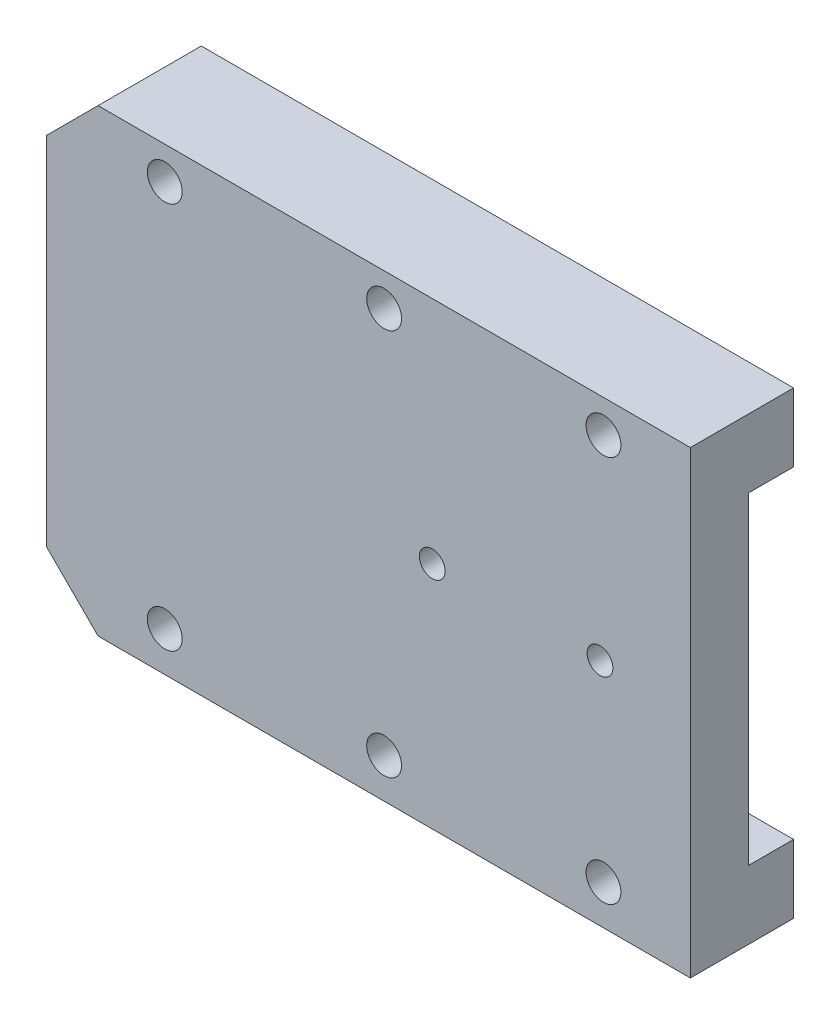
ISO-10303-21;
HEADER;
FILE_DESCRIPTION(('STEP AP214'),'2;1');
FILE_NAME('part.step','',(''),(''),'','','');
FILE_SCHEMA(('AUTOMOTIVE_DESIGN { 1 0 10303 214 1 1 1 1 }'));
ENDSEC;
DATA;
#1=APPLICATION_CONTEXT('core data for automotive mechanical design processes');
#2=APPLICATION_PROTOCOL_DEFINITION('international standard','automotive_design',2000,#1);
#3=PRODUCT_CONTEXT('',#1,'mechanical');
#4=PRODUCT('Part','Part','',(#3));
#5=PRODUCT_RELATED_PRODUCT_CATEGORY('part','',(#4));
#6=PRODUCT_DEFINITION_FORMATION('','',#4);
#7=PRODUCT_DEFINITION_CONTEXT('part definition',#1,'design');
#8=PRODUCT_DEFINITION('design','',#6,#7);
#9=PRODUCT_DEFINITION_SHAPE('','',#8);
#10=(LENGTH_UNIT() NAMED_UNIT(*) SI_UNIT(.MILLI.,.METRE.));
#11=(NAMED_UNIT(*) PLANE_ANGLE_UNIT() SI_UNIT($,.RADIAN.));
#12=(NAMED_UNIT(*) SI_UNIT($,.STERADIAN.) SOLID_ANGLE_UNIT());
#13=UNCERTAINTY_MEASURE_WITH_UNIT(LENGTH_MEASURE(1.E-05),#10,'distance_accuracy_value','');
#14=(GEOMETRIC_REPRESENTATION_CONTEXT(3) GLOBAL_UNCERTAINTY_ASSIGNED_CONTEXT((#13)) GLOBAL_UNIT_ASSIGNED_CONTEXT((#10,
#11,#12)) REPRESENTATION_CONTEXT('',''));
#15=CARTESIAN_POINT('',(0.,0.,0.));
#16=DIRECTION('',(0.,0.,1.));
#17=DIRECTION('',(1.,0.,0.));
#18=AXIS2_PLACEMENT_3D('',#15,#16,#17);
#19=CARTESIAN_POINT('',(0.,0.,-4.));
#20=DIRECTION('',(0.,0.,-1.));
#21=DIRECTION('',(-1.,0.,0.));
#22=AXIS2_PLACEMENT_3D('',#19,#20,#21);
#23=PLANE('',#22);
#24=DIRECTION('',(-1.,0.,0.));
#25=VECTOR('',#24,1.);
#26=CARTESIAN_POINT('',(22.5,12.5,-4.));
#27=LINE('',#26,#25);
#28=CARTESIAN_POINT('',(22.5,12.5,-4.));
#29=VERTEX_POINT('',#28);
#30=CARTESIAN_POINT('',(-27.4,12.5,-4.));
#31=VERTEX_POINT('',#30);
#32=EDGE_CURVE('E171',#29,#31,#27,.T.);
#33=ORIENTED_EDGE('',*,*,#32,.T.);
#34=DIRECTION('',(0.,1.,0.));
#35=VECTOR('',#34,1.);
#36=CARTESIAN_POINT('',(-27.4,17.8,-4.));
#37=LINE('',#36,#35);
#38=CARTESIAN_POINT('',(-27.4,13.8,-4.));
#39=VERTEX_POINT('',#38);
#40=EDGE_CURVE('E174',#31,#39,#37,.T.);
#41=ORIENTED_EDGE('',*,*,#40,.T.);
#42=DIRECTION('',(0.707106781186549,0.707106781186546,0.));
#43=VECTOR('',#42,1.);
#44=CARTESIAN_POINT('',(-20.6,20.6,-4.));
#45=LINE('',#44,#43);
#46=CARTESIAN_POINT('',(-23.4,17.8,-4.));
#47=VERTEX_POINT('',#46);
#48=EDGE_CURVE('E144',#39,#47,#45,.T.);
#49=ORIENTED_EDGE('',*,*,#48,.T.);
#50=DIRECTION('',(-1.,0.,0.));
#51=VECTOR('',#50,1.);
#52=CARTESIAN_POINT('',(22.5,17.8,-4.));
#53=LINE('',#52,#51);
#54=CARTESIAN_POINT('',(22.5,17.8,-4.));
#55=VERTEX_POINT('',#54);
#56=EDGE_CURVE('E122',#55,#47,#53,.T.);
#57=ORIENTED_EDGE('',*,*,#56,.F.);
#58=DIRECTION('',(0.,1.,0.));
#59=VECTOR('',#58,1.);
#60=CARTESIAN_POINT('',(22.5,17.8,-4.));
#61=LINE('',#60,#59);
#62=EDGE_CURVE('E123',#29,#55,#61,.T.);
#63=ORIENTED_EDGE('',*,*,#62,.F.);
#64=EDGE_LOOP('',(#33,#41,#49,#57,#63));
#65=FACE_BOUND('',#64,.T.);
#66=CARTESIAN_POINT('',(-18.2306151546301,15.26709885284,-4.));
#67=DIRECTION('',(0.,0.,-1.));
#68=DIRECTION('',(-1.,0.,0.));
#69=AXIS2_PLACEMENT_3D('',#66,#67,#68);
#70=CIRCLE('',#69,1.35);
#71=CARTESIAN_POINT('',(-19.5806151546301,15.26709885284,-4.));
#72=VERTEX_POINT('',#71);
#73=EDGE_CURVE('E191',#72,#72,#70,.T.);
#74=ORIENTED_EDGE('',*,*,#73,.F.);
#75=EDGE_LOOP('',(#74));
#76=FACE_BOUND('',#75,.T.);
#77=CARTESIAN_POINT('',(-1.23061515463011,15.2670988528399,-4.));
#78=DIRECTION('',(0.,0.,-1.));
#79=DIRECTION('',(-1.,0.,0.));
#80=AXIS2_PLACEMENT_3D('',#77,#78,#79);
#81=CIRCLE('',#80,1.35);
#82=CARTESIAN_POINT('',(-2.58061515463011,15.2670988528399,-4.));
#83=VERTEX_POINT('',#82);
#84=EDGE_CURVE('E185',#83,#83,#81,.T.);
#85=ORIENTED_EDGE('',*,*,#84,.F.);
#86=EDGE_LOOP('',(#85));
#87=FACE_BOUND('',#86,.T.);
#88=CARTESIAN_POINT('',(15.7693848453699,15.2670988528398,-4.));
#89=DIRECTION('',(0.,0.,-1.));
#90=DIRECTION('',(-1.,0.,0.));
#91=AXIS2_PLACEMENT_3D('',#88,#89,#90);
#92=CIRCLE('',#91,1.35);
#93=CARTESIAN_POINT('',(14.4193848453699,15.2670988528398,-4.));
#94=VERTEX_POINT('',#93);
#95=EDGE_CURVE('E180',#94,#94,#92,.T.);
#96=ORIENTED_EDGE('',*,*,#95,.F.);
#97=EDGE_LOOP('',(#96));
#98=FACE_BOUND('',#97,.T.);
#99=ADVANCED_FACE('F17',(#65,#76,#87,#98),#23,.T.);
#100=CARTESIAN_POINT('',(22.5,-17.8,4.));
#101=DIRECTION('',(0.,1.,0.));
#102=DIRECTION('',(-1.,0.,0.));
#103=AXIS2_PLACEMENT_3D('',#100,#101,#102);
#104=PLANE('',#103);
#105=DIRECTION('',(1.,0.,0.));
#106=VECTOR('',#105,1.);
#107=CARTESIAN_POINT('',(22.5,-17.8,4.));
#108=LINE('',#107,#106);
#109=CARTESIAN_POINT('',(-23.4,-17.8,4.));
#110=VERTEX_POINT('',#109);
#111=CARTESIAN_POINT('',(22.5,-17.8,4.));
#112=VERTEX_POINT('',#111);
#113=EDGE_CURVE('E126',#110,#112,#108,.T.);
#114=ORIENTED_EDGE('',*,*,#113,.F.);
#115=DIRECTION('',(0.,0.,-1.));
#116=VECTOR('',#115,1.);
#117=CARTESIAN_POINT('',(-23.4,-17.8,-4.));
#118=LINE('',#117,#116);
#119=CARTESIAN_POINT('',(-23.4,-17.8,-4.));
#120=VERTEX_POINT('',#119);
#121=EDGE_CURVE('E11',#110,#120,#118,.T.);
#122=ORIENTED_EDGE('',*,*,#121,.T.);
#123=DIRECTION('',(1.,0.,0.));
#124=VECTOR('',#123,1.);
#125=CARTESIAN_POINT('',(22.5,-17.8,-4.));
#126=LINE('',#125,#124);
#127=CARTESIAN_POINT('',(22.5,-17.8,-4.));
#128=VERTEX_POINT('',#127);
#129=EDGE_CURVE('E128',#120,#128,#126,.T.);
#130=ORIENTED_EDGE('',*,*,#129,.T.);
#131=DIRECTION('',(0.,0.,-1.));
#132=VECTOR('',#131,1.);
#133=CARTESIAN_POINT('',(22.5,-17.8,4.));
#134=LINE('',#133,#132);
#135=EDGE_CURVE('E121',#112,#128,#134,.T.);
#136=ORIENTED_EDGE('',*,*,#135,.F.);
#137=EDGE_LOOP('',(#114,#122,#130,#136));
#138=FACE_BOUND('',#137,.T.);
#139=ADVANCED_FACE('F239',(#138),#104,.F.);
#140=CARTESIAN_POINT('',(22.5,17.8,4.));
#141=DIRECTION('',(-1.,0.,0.));
#142=DIRECTION('',(0.,0.,1.));
#143=AXIS2_PLACEMENT_3D('',#140,#141,#142);
#144=PLANE('',#143);
#145=DIRECTION('',(0.,1.,0.));
#146=VECTOR('',#145,1.);
#147=CARTESIAN_POINT('',(22.5,12.5,-0.5));
#148=LINE('',#147,#146);
#149=CARTESIAN_POINT('',(22.5,-12.5,-0.5));
#150=VERTEX_POINT('',#149);
#151=CARTESIAN_POINT('',(22.5,12.5,-0.5));
#152=VERTEX_POINT('',#151);
#153=EDGE_CURVE('E103',#150,#152,#148,.T.);
#154=ORIENTED_EDGE('',*,*,#153,.T.);
#155=DIRECTION('',(0.,0.,-1.));
#156=VECTOR('',#155,1.);
#157=CARTESIAN_POINT('',(22.5,12.5,-0.5));
#158=LINE('',#157,#156);
#159=EDGE_CURVE('E115',#152,#29,#158,.T.);
#160=ORIENTED_EDGE('',*,*,#159,.T.);
#161=ORIENTED_EDGE('',*,*,#62,.T.);
#162=DIRECTION('',(0.,0.,-1.));
#163=VECTOR('',#162,1.);
#164=CARTESIAN_POINT('',(22.5,17.8,4.));
#165=LINE('',#164,#163);
#166=CARTESIAN_POINT('',(22.5,17.8,4.));
#167=VERTEX_POINT('',#166);
#168=EDGE_CURVE('E132',#167,#55,#165,.T.);
#169=ORIENTED_EDGE('',*,*,#168,.F.);
#170=DIRECTION('',(0.,1.,0.));
#171=VECTOR('',#170,1.);
#172=CARTESIAN_POINT('',(22.5,17.8,4.));
#173=LINE('',#172,#171);
#174=EDGE_CURVE('E218',#112,#167,#173,.T.);
#175=ORIENTED_EDGE('',*,*,#174,.F.);
#176=ORIENTED_EDGE('',*,*,#135,.T.);
#177=CARTESIAN_POINT('',(22.5,-12.5,-4.));
#178=VERTEX_POINT('',#177);
#179=EDGE_CURVE('E112',#128,#178,#61,.T.);
#180=ORIENTED_EDGE('',*,*,#179,.T.);
#181=DIRECTION('',(0.,0.,1.));
#182=VECTOR('',#181,1.);
#183=CARTESIAN_POINT('',(22.5,-12.5,-0.5));
#184=LINE('',#183,#182);
#185=EDGE_CURVE('E96',#178,#150,#184,.T.);
#186=ORIENTED_EDGE('',*,*,#185,.T.);
#187=EDGE_LOOP('',(#154,#160,#161,#169,#175,#176,#180,#186));
#188=FACE_BOUND('',#187,.T.);
#189=ADVANCED_FACE('F118',(#188),#144,.F.);
#190=CARTESIAN_POINT('',(22.5,17.8,4.));
#191=DIRECTION('',(0.,-1.,0.));
#192=DIRECTION('',(1.,0.,0.));
#193=AXIS2_PLACEMENT_3D('',#190,#191,#192);
#194=PLANE('',#193);
#195=ORIENTED_EDGE('',*,*,#56,.T.);
#196=DIRECTION('',(0.,0.,1.));
#197=VECTOR('',#196,1.);
#198=CARTESIAN_POINT('',(-23.4,17.8,4.));
#199=LINE('',#198,#197);
#200=CARTESIAN_POINT('',(-23.4,17.8,4.));
#201=VERTEX_POINT('',#200);
#202=EDGE_CURVE('E146',#47,#201,#199,.T.);
#203=ORIENTED_EDGE('',*,*,#202,.T.);
#204=DIRECTION('',(-1.,0.,0.));
#205=VECTOR('',#204,1.);
#206=CARTESIAN_POINT('',(22.5,17.8,4.));
#207=LINE('',#206,#205);
#208=EDGE_CURVE('E135',#167,#201,#207,.T.);
#209=ORIENTED_EDGE('',*,*,#208,.F.);
#210=ORIENTED_EDGE('',*,*,#168,.T.);
#211=EDGE_LOOP('',(#195,#203,#209,#210));
#212=FACE_BOUND('',#211,.T.);
#213=ADVANCED_FACE('F249',(#212),#194,.F.);
#214=CARTESIAN_POINT('',(0.,0.,4.));
#215=DIRECTION('',(0.,0.,-1.));
#216=DIRECTION('',(-1.,0.,0.));
#217=AXIS2_PLACEMENT_3D('',#214,#215,#216);
#218=PLANE('',#217);
#219=CARTESIAN_POINT('',(15.5,0.,4.));
#220=DIRECTION('',(0.,0.,1.));
#221=DIRECTION('',(1.,0.,0.));
#222=AXIS2_PLACEMENT_3D('',#219,#220,#221);
#223=CIRCLE('',#222,1.);
#224=CARTESIAN_POINT('',(16.5,0.,4.));
#225=VERTEX_POINT('',#224);
#226=EDGE_CURVE('E162',#225,#225,#223,.T.);
#227=ORIENTED_EDGE('',*,*,#226,.F.);
#228=EDGE_LOOP('',(#227));
#229=FACE_BOUND('',#228,.T.);
#230=CARTESIAN_POINT('',(2.5,0.,4.));
#231=DIRECTION('',(0.,0.,1.));
#232=DIRECTION('',(1.,0.,0.));
#233=AXIS2_PLACEMENT_3D('',#230,#231,#232);
#234=CIRCLE('',#233,1.);
#235=CARTESIAN_POINT('',(3.5,0.,4.));
#236=VERTEX_POINT('',#235);
#237=EDGE_CURVE('E152',#236,#236,#234,.T.);
#238=ORIENTED_EDGE('',*,*,#237,.F.);
#239=EDGE_LOOP('',(#238));
#240=FACE_BOUND('',#239,.T.);
#241=CARTESIAN_POINT('',(15.7693848453699,15.2670988528398,4.));
#242=DIRECTION('',(0.,0.,-1.));
#243=DIRECTION('',(-1.,0.,0.));
#244=AXIS2_PLACEMENT_3D('',#241,#242,#243);
#245=CIRCLE('',#244,1.35);
#246=CARTESIAN_POINT('',(14.4193848453699,15.2670988528398,4.));
#247=VERTEX_POINT('',#246);
#248=EDGE_CURVE('E182',#247,#247,#245,.T.);
#249=ORIENTED_EDGE('',*,*,#248,.T.);
#250=EDGE_LOOP('',(#249));
#251=FACE_BOUND('',#250,.T.);
#252=CARTESIAN_POINT('',(-1.23061515463011,15.2670988528399,4.));
#253=DIRECTION('',(0.,0.,-1.));
#254=DIRECTION('',(-1.,0.,0.));
#255=AXIS2_PLACEMENT_3D('',#252,#253,#254);
#256=CIRCLE('',#255,1.35);
#257=CARTESIAN_POINT('',(-2.58061515463011,15.2670988528399,4.));
#258=VERTEX_POINT('',#257);
#259=EDGE_CURVE('E188',#258,#258,#256,.T.);
#260=ORIENTED_EDGE('',*,*,#259,.T.);
#261=EDGE_LOOP('',(#260));
#262=FACE_BOUND('',#261,.T.);
#263=CARTESIAN_POINT('',(-18.2306151546301,15.26709885284,4.));
#264=DIRECTION('',(0.,0.,-1.));
#265=DIRECTION('',(-1.,0.,0.));
#266=AXIS2_PLACEMENT_3D('',#263,#264,#265);
#267=CIRCLE('',#266,1.35);
#268=CARTESIAN_POINT('',(-19.5806151546301,15.26709885284,4.));
#269=VERTEX_POINT('',#268);
#270=EDGE_CURVE('E194',#269,#269,#267,.T.);
#271=ORIENTED_EDGE('',*,*,#270,.T.);
#272=EDGE_LOOP('',(#271));
#273=FACE_BOUND('',#272,.T.);
#274=CARTESIAN_POINT('',(-18.2306151546302,-14.7329011471601,4.));
#275=DIRECTION('',(0.,0.,-1.));
#276=DIRECTION('',(-1.,0.,0.));
#277=AXIS2_PLACEMENT_3D('',#274,#275,#276);
#278=CIRCLE('',#277,1.35);
#279=CARTESIAN_POINT('',(-19.5806151546302,-14.7329011471601,4.));
#280=VERTEX_POINT('',#279);
#281=EDGE_CURVE('E200',#280,#280,#278,.T.);
#282=ORIENTED_EDGE('',*,*,#281,.T.);
#283=EDGE_LOOP('',(#282));
#284=FACE_BOUND('',#283,.T.);
#285=CARTESIAN_POINT('',(-1.23061515463022,-14.7329011471601,4.));
#286=DIRECTION('',(0.,0.,-1.));
#287=DIRECTION('',(-1.,0.,0.));
#288=AXIS2_PLACEMENT_3D('',#285,#286,#287);
#289=CIRCLE('',#288,1.35);
#290=CARTESIAN_POINT('',(-2.58061515463022,-14.7329011471601,4.));
#291=VERTEX_POINT('',#290);
#292=EDGE_CURVE('E206',#291,#291,#289,.T.);
#293=ORIENTED_EDGE('',*,*,#292,.T.);
#294=EDGE_LOOP('',(#293));
#295=FACE_BOUND('',#294,.T.);
#296=CARTESIAN_POINT('',(15.7693848453698,-14.7329011471602,4.));
#297=DIRECTION('',(0.,0.,-1.));
#298=DIRECTION('',(-1.,0.,0.));
#299=AXIS2_PLACEMENT_3D('',#296,#297,#298);
#300=CIRCLE('',#299,1.35);
#301=CARTESIAN_POINT('',(14.4193848453698,-14.7329011471602,4.));
#302=VERTEX_POINT('',#301);
#303=EDGE_CURVE('E212',#302,#302,#300,.T.);
#304=ORIENTED_EDGE('',*,*,#303,.T.);
#305=EDGE_LOOP('',(#304));
#306=FACE_BOUND('',#305,.T.);
#307=ORIENTED_EDGE('',*,*,#208,.T.);
#308=DIRECTION('',(-0.707106781186549,-0.707106781186546,0.));
#309=VECTOR('',#308,1.);
#310=CARTESIAN_POINT('',(-27.4,13.8,4.));
#311=LINE('',#310,#309);
#312=CARTESIAN_POINT('',(-27.4,13.8,4.));
#313=VERTEX_POINT('',#312);
#314=EDGE_CURVE('E26',#201,#313,#311,.T.);
#315=ORIENTED_EDGE('',*,*,#314,.T.);
#316=DIRECTION('',(0.,-1.,0.));
#317=VECTOR('',#316,1.);
#318=CARTESIAN_POINT('',(-27.4,17.8,4.));
#319=LINE('',#318,#317);
#320=CARTESIAN_POINT('',(-27.4,-13.8,4.));
#321=VERTEX_POINT('',#320);
#322=EDGE_CURVE('E178',#313,#321,#319,.T.);
#323=ORIENTED_EDGE('',*,*,#322,.T.);
#324=DIRECTION('',(0.707106781186547,-0.707106781186548,0.));
#325=VECTOR('',#324,1.);
#326=CARTESIAN_POINT('',(-23.4,-17.8,4.));
#327=LINE('',#326,#325);
#328=EDGE_CURVE('E42',#321,#110,#327,.T.);
#329=ORIENTED_EDGE('',*,*,#328,.T.);
#330=ORIENTED_EDGE('',*,*,#113,.T.);
#331=ORIENTED_EDGE('',*,*,#174,.T.);
#332=EDGE_LOOP('',(#307,#315,#323,#329,#330,#331));
#333=FACE_BOUND('',#332,.T.);
#334=ADVANCED_FACE('F222',(#229,#240,#251,#262,#273,#284,#295,#306,#333),#218,.F.);
#335=DIRECTION('',(-1.,0.,0.));
#336=VECTOR('',#335,1.);
#337=CARTESIAN_POINT('',(22.5,-12.5,-4.));
#338=LINE('',#337,#336);
#339=CARTESIAN_POINT('',(-27.4,-12.5,-4.));
#340=VERTEX_POINT('',#339);
#341=EDGE_CURVE('E34',#178,#340,#338,.T.);
#342=ORIENTED_EDGE('',*,*,#341,.F.);
#343=ORIENTED_EDGE('',*,*,#179,.F.);
#344=ORIENTED_EDGE('',*,*,#129,.F.);
#345=DIRECTION('',(-0.707106781186547,0.707106781186548,0.));
#346=VECTOR('',#345,1.);
#347=CARTESIAN_POINT('',(-20.6,-20.6,-4.));
#348=LINE('',#347,#346);
#349=CARTESIAN_POINT('',(-27.4,-13.8,-4.));
#350=VERTEX_POINT('',#349);
#351=EDGE_CURVE('E142',#120,#350,#348,.T.);
#352=ORIENTED_EDGE('',*,*,#351,.T.);
#353=EDGE_CURVE('E114',#350,#340,#37,.T.);
#354=ORIENTED_EDGE('',*,*,#353,.T.);
#355=EDGE_LOOP('',(#342,#343,#344,#352,#354));
#356=FACE_BOUND('',#355,.T.);
#357=CARTESIAN_POINT('',(-18.2306151546302,-14.7329011471601,-4.));
#358=DIRECTION('',(0.,0.,-1.));
#359=DIRECTION('',(-1.,0.,0.));
#360=AXIS2_PLACEMENT_3D('',#357,#358,#359);
#361=CIRCLE('',#360,1.35);
#362=CARTESIAN_POINT('',(-19.5806151546302,-14.7329011471601,-4.));
#363=VERTEX_POINT('',#362);
#364=EDGE_CURVE('E197',#363,#363,#361,.T.);
#365=ORIENTED_EDGE('',*,*,#364,.F.);
#366=EDGE_LOOP('',(#365));
#367=FACE_BOUND('',#366,.T.);
#368=CARTESIAN_POINT('',(-1.23061515463022,-14.7329011471601,-4.));
#369=DIRECTION('',(0.,0.,-1.));
#370=DIRECTION('',(-1.,0.,0.));
#371=AXIS2_PLACEMENT_3D('',#368,#369,#370);
#372=CIRCLE('',#371,1.35);
#373=CARTESIAN_POINT('',(-2.58061515463022,-14.7329011471601,-4.));
#374=VERTEX_POINT('',#373);
#375=EDGE_CURVE('E203',#374,#374,#372,.T.);
#376=ORIENTED_EDGE('',*,*,#375,.F.);
#377=EDGE_LOOP('',(#376));
#378=FACE_BOUND('',#377,.T.);
#379=CARTESIAN_POINT('',(15.7693848453698,-14.7329011471602,-4.));
#380=DIRECTION('',(0.,0.,-1.));
#381=DIRECTION('',(-1.,0.,0.));
#382=AXIS2_PLACEMENT_3D('',#379,#380,#381);
#383=CIRCLE('',#382,1.35);
#384=CARTESIAN_POINT('',(14.4193848453698,-14.7329011471602,-4.));
#385=VERTEX_POINT('',#384);
#386=EDGE_CURVE('E209',#385,#385,#383,.T.);
#387=ORIENTED_EDGE('',*,*,#386,.F.);
#388=EDGE_LOOP('',(#387));
#389=FACE_BOUND('',#388,.T.);
#390=ADVANCED_FACE('F109',(#356,#367,#378,#389),#23,.T.);
#391=CARTESIAN_POINT('',(15.7693848453698,-14.7329011471602,4.));
#392=DIRECTION('',(0.,0.,-1.));
#393=DIRECTION('',(-1.,0.,0.));
#394=AXIS2_PLACEMENT_3D('',#391,#392,#393);
#395=CYLINDRICAL_SURFACE('',#394,1.35);
#396=ORIENTED_EDGE('',*,*,#303,.F.);
#397=EDGE_LOOP('',(#396));
#398=FACE_BOUND('',#397,.T.);
#399=ORIENTED_EDGE('',*,*,#386,.T.);
#400=EDGE_LOOP('',(#399));
#401=FACE_BOUND('',#400,.T.);
#402=ADVANCED_FACE('F267',(#398,#401),#395,.F.);
#403=CARTESIAN_POINT('',(-1.23061515463022,-14.7329011471601,4.));
#404=DIRECTION('',(0.,0.,-1.));
#405=DIRECTION('',(-1.,0.,0.));
#406=AXIS2_PLACEMENT_3D('',#403,#404,#405);
#407=CYLINDRICAL_SURFACE('',#406,1.35);
#408=ORIENTED_EDGE('',*,*,#292,.F.);
#409=EDGE_LOOP('',(#408));
#410=FACE_BOUND('',#409,.T.);
#411=ORIENTED_EDGE('',*,*,#375,.T.);
#412=EDGE_LOOP('',(#411));
#413=FACE_BOUND('',#412,.T.);
#414=ADVANCED_FACE('F271',(#410,#413),#407,.F.);
#415=CARTESIAN_POINT('',(-18.2306151546302,-14.7329011471601,4.));
#416=DIRECTION('',(0.,0.,-1.));
#417=DIRECTION('',(-1.,0.,0.));
#418=AXIS2_PLACEMENT_3D('',#415,#416,#417);
#419=CYLINDRICAL_SURFACE('',#418,1.35);
#420=ORIENTED_EDGE('',*,*,#281,.F.);
#421=EDGE_LOOP('',(#420));
#422=FACE_BOUND('',#421,.T.);
#423=ORIENTED_EDGE('',*,*,#364,.T.);
#424=EDGE_LOOP('',(#423));
#425=FACE_BOUND('',#424,.T.);
#426=ADVANCED_FACE('F277',(#422,#425),#419,.F.);
#427=CARTESIAN_POINT('',(-18.2306151546301,15.26709885284,4.));
#428=DIRECTION('',(0.,0.,-1.));
#429=DIRECTION('',(-1.,0.,0.));
#430=AXIS2_PLACEMENT_3D('',#427,#428,#429);
#431=CYLINDRICAL_SURFACE('',#430,1.35);
#432=ORIENTED_EDGE('',*,*,#270,.F.);
#433=EDGE_LOOP('',(#432));
#434=FACE_BOUND('',#433,.T.);
#435=ORIENTED_EDGE('',*,*,#73,.T.);
#436=EDGE_LOOP('',(#435));
#437=FACE_BOUND('',#436,.T.);
#438=ADVANCED_FACE('F285',(#434,#437),#431,.F.);
#439=CARTESIAN_POINT('',(-1.23061515463011,15.2670988528399,4.));
#440=DIRECTION('',(0.,0.,-1.));
#441=DIRECTION('',(-1.,0.,0.));
#442=AXIS2_PLACEMENT_3D('',#439,#440,#441);
#443=CYLINDRICAL_SURFACE('',#442,1.35);
#444=ORIENTED_EDGE('',*,*,#259,.F.);
#445=EDGE_LOOP('',(#444));
#446=FACE_BOUND('',#445,.T.);
#447=ORIENTED_EDGE('',*,*,#84,.T.);
#448=EDGE_LOOP('',(#447));
#449=FACE_BOUND('',#448,.T.);
#450=ADVANCED_FACE('F289',(#446,#449),#443,.F.);
#451=CARTESIAN_POINT('',(15.7693848453699,15.2670988528398,4.));
#452=DIRECTION('',(0.,0.,-1.));
#453=DIRECTION('',(-1.,0.,0.));
#454=AXIS2_PLACEMENT_3D('',#451,#452,#453);
#455=CYLINDRICAL_SURFACE('',#454,1.35);
#456=ORIENTED_EDGE('',*,*,#248,.F.);
#457=EDGE_LOOP('',(#456));
#458=FACE_BOUND('',#457,.T.);
#459=ORIENTED_EDGE('',*,*,#95,.T.);
#460=EDGE_LOOP('',(#459));
#461=FACE_BOUND('',#460,.T.);
#462=ADVANCED_FACE('F293',(#458,#461),#455,.F.);
#463=CARTESIAN_POINT('',(-27.4,17.8,39.9356369082281));
#464=DIRECTION('',(-1.,0.,0.));
#465=DIRECTION('',(0.,-1.,0.));
#466=AXIS2_PLACEMENT_3D('',#463,#464,#465);
#467=PLANE('',#466);
#468=DIRECTION('',(0.,0.,-1.));
#469=VECTOR('',#468,1.);
#470=CARTESIAN_POINT('',(-27.4,12.5,-0.5));
#471=LINE('',#470,#469);
#472=CARTESIAN_POINT('',(-27.4,12.5,-0.5));
#473=VERTEX_POINT('',#472);
#474=EDGE_CURVE('E104',#473,#31,#471,.T.);
#475=ORIENTED_EDGE('',*,*,#474,.F.);
#476=DIRECTION('',(0.,1.,0.));
#477=VECTOR('',#476,1.);
#478=CARTESIAN_POINT('',(-27.4,12.5,-0.5));
#479=LINE('',#478,#477);
#480=CARTESIAN_POINT('',(-27.4,-12.5,-0.5));
#481=VERTEX_POINT('',#480);
#482=EDGE_CURVE('E155',#481,#473,#479,.T.);
#483=ORIENTED_EDGE('',*,*,#482,.F.);
#484=DIRECTION('',(0.,0.,1.));
#485=VECTOR('',#484,1.);
#486=CARTESIAN_POINT('',(-27.4,-12.5,-0.5));
#487=LINE('',#486,#485);
#488=EDGE_CURVE('E151',#340,#481,#487,.T.);
#489=ORIENTED_EDGE('',*,*,#488,.F.);
#490=ORIENTED_EDGE('',*,*,#353,.F.);
#491=DIRECTION('',(0.,0.,1.));
#492=VECTOR('',#491,1.);
#493=CARTESIAN_POINT('',(-27.4,-13.8,4.));
#494=LINE('',#493,#492);
#495=EDGE_CURVE('E137',#350,#321,#494,.T.);
#496=ORIENTED_EDGE('',*,*,#495,.T.);
#497=ORIENTED_EDGE('',*,*,#322,.F.);
#498=DIRECTION('',(0.,0.,-1.));
#499=VECTOR('',#498,1.);
#500=CARTESIAN_POINT('',(-27.4,13.8,-4.));
#501=LINE('',#500,#499);
#502=EDGE_CURVE('E139',#313,#39,#501,.T.);
#503=ORIENTED_EDGE('',*,*,#502,.T.);
#504=ORIENTED_EDGE('',*,*,#40,.F.);
#505=EDGE_LOOP('',(#475,#483,#489,#490,#496,#497,#503,#504));
#506=FACE_BOUND('',#505,.T.);
#507=ADVANCED_FACE('F234',(#506),#467,.T.);
#508=CARTESIAN_POINT('',(-27.4,13.8,39.9356369082281));
#509=DIRECTION('',(-0.707106781186546,0.707106781186549,0.));
#510=DIRECTION('',(0.,0.,1.));
#511=AXIS2_PLACEMENT_3D('',#508,#509,#510);
#512=PLANE('',#511);
#513=ORIENTED_EDGE('',*,*,#314,.F.);
#514=ORIENTED_EDGE('',*,*,#202,.F.);
#515=ORIENTED_EDGE('',*,*,#48,.F.);
#516=ORIENTED_EDGE('',*,*,#502,.F.);
#517=EDGE_LOOP('',(#513,#514,#515,#516));
#518=FACE_BOUND('',#517,.T.);
#519=ADVANCED_FACE('F229',(#518),#512,.T.);
#520=CARTESIAN_POINT('',(-23.4,-17.8,4.));
#521=DIRECTION('',(-0.707106781186548,-0.707106781186547,0.));
#522=DIRECTION('',(0.,0.,1.));
#523=AXIS2_PLACEMENT_3D('',#520,#521,#522);
#524=PLANE('',#523);
#525=ORIENTED_EDGE('',*,*,#328,.F.);
#526=ORIENTED_EDGE('',*,*,#495,.F.);
#527=ORIENTED_EDGE('',*,*,#351,.F.);
#528=ORIENTED_EDGE('',*,*,#121,.F.);
#529=EDGE_LOOP('',(#525,#526,#527,#528));
#530=FACE_BOUND('',#529,.T.);
#531=ADVANCED_FACE('F19',(#530),#524,.T.);
#532=CARTESIAN_POINT('',(22.5,12.5,-0.5));
#533=DIRECTION('',(0.,1.,0.));
#534=DIRECTION('',(-1.,0.,0.));
#535=AXIS2_PLACEMENT_3D('',#532,#533,#534);
#536=PLANE('',#535);
#537=ORIENTED_EDGE('',*,*,#474,.T.);
#538=ORIENTED_EDGE('',*,*,#32,.F.);
#539=ORIENTED_EDGE('',*,*,#159,.F.);
#540=DIRECTION('',(-1.,0.,0.));
#541=VECTOR('',#540,1.);
#542=CARTESIAN_POINT('',(22.5,12.5,-0.5));
#543=LINE('',#542,#541);
#544=EDGE_CURVE('E175',#152,#473,#543,.T.);
#545=ORIENTED_EDGE('',*,*,#544,.T.);
#546=EDGE_LOOP('',(#537,#538,#539,#545));
#547=FACE_BOUND('',#546,.T.);
#548=ADVANCED_FACE('F305',(#547),#536,.F.);
#549=CARTESIAN_POINT('',(22.5,12.5,-0.5));
#550=DIRECTION('',(0.,0.,1.));
#551=DIRECTION('',(0.,-1.,0.));
#552=AXIS2_PLACEMENT_3D('',#549,#550,#551);
#553=PLANE('',#552);
#554=CARTESIAN_POINT('',(15.5,0.,-0.5));
#555=DIRECTION('',(0.,0.,1.));
#556=DIRECTION('',(0.,-1.,0.));
#557=AXIS2_PLACEMENT_3D('',#554,#555,#556);
#558=CIRCLE('',#557,1.);
#559=CARTESIAN_POINT('',(15.5,-1.,-0.5));
#560=VERTEX_POINT('',#559);
#561=EDGE_CURVE('E21',#560,#560,#558,.T.);
#562=ORIENTED_EDGE('',*,*,#561,.T.);
#563=EDGE_LOOP('',(#562));
#564=FACE_BOUND('',#563,.T.);
#565=CARTESIAN_POINT('',(2.5,0.,-0.5));
#566=DIRECTION('',(0.,0.,1.));
#567=DIRECTION('',(0.,-1.,0.));
#568=AXIS2_PLACEMENT_3D('',#565,#566,#567);
#569=CIRCLE('',#568,1.);
#570=CARTESIAN_POINT('',(2.5,-1.,-0.5));
#571=VERTEX_POINT('',#570);
#572=EDGE_CURVE('E149',#571,#571,#569,.T.);
#573=ORIENTED_EDGE('',*,*,#572,.T.);
#574=EDGE_LOOP('',(#573));
#575=FACE_BOUND('',#574,.T.);
#576=ORIENTED_EDGE('',*,*,#482,.T.);
#577=ORIENTED_EDGE('',*,*,#544,.F.);
#578=ORIENTED_EDGE('',*,*,#153,.F.);
#579=DIRECTION('',(-1.,0.,0.));
#580=VECTOR('',#579,1.);
#581=CARTESIAN_POINT('',(22.5,-12.5,-0.5));
#582=LINE('',#581,#580);
#583=EDGE_CURVE('E98',#150,#481,#582,.T.);
#584=ORIENTED_EDGE('',*,*,#583,.T.);
#585=EDGE_LOOP('',(#576,#577,#578,#584));
#586=FACE_BOUND('',#585,.T.);
#587=ADVANCED_FACE('F242',(#564,#575,#586),#553,.F.);
#588=CARTESIAN_POINT('',(22.5,-12.5,-0.5));
#589=DIRECTION('',(0.,-1.,0.));
#590=DIRECTION('',(1.,0.,0.));
#591=AXIS2_PLACEMENT_3D('',#588,#589,#590);
#592=PLANE('',#591);
#593=ORIENTED_EDGE('',*,*,#488,.T.);
#594=ORIENTED_EDGE('',*,*,#583,.F.);
#595=ORIENTED_EDGE('',*,*,#185,.F.);
#596=ORIENTED_EDGE('',*,*,#341,.T.);
#597=EDGE_LOOP('',(#593,#594,#595,#596));
#598=FACE_BOUND('',#597,.T.);
#599=ADVANCED_FACE('F97',(#598),#592,.F.);
#600=CARTESIAN_POINT('',(2.5,0.,-4.));
#601=DIRECTION('',(0.,0.,1.));
#602=DIRECTION('',(1.,0.,0.));
#603=AXIS2_PLACEMENT_3D('',#600,#601,#602);
#604=CYLINDRICAL_SURFACE('',#603,1.);
#605=ORIENTED_EDGE('',*,*,#237,.T.);
#606=EDGE_LOOP('',(#605));
#607=FACE_BOUND('',#606,.T.);
#608=ORIENTED_EDGE('',*,*,#572,.F.);
#609=EDGE_LOOP('',(#608));
#610=FACE_BOUND('',#609,.T.);
#611=ADVANCED_FACE('F302',(#607,#610),#604,.F.);
#612=CARTESIAN_POINT('',(15.5,0.,-4.));
#613=DIRECTION('',(0.,0.,1.));
#614=DIRECTION('',(1.,0.,0.));
#615=AXIS2_PLACEMENT_3D('',#612,#613,#614);
#616=CYLINDRICAL_SURFACE('',#615,1.);
#617=ORIENTED_EDGE('',*,*,#226,.T.);
#618=EDGE_LOOP('',(#617));
#619=FACE_BOUND('',#618,.T.);
#620=ORIENTED_EDGE('',*,*,#561,.F.);
#621=EDGE_LOOP('',(#620));
#622=FACE_BOUND('',#621,.T.);
#623=ADVANCED_FACE('F311',(#619,#622),#616,.F.);
#624=CLOSED_SHELL('',(#99,#139,#189,#213,#334,#390,#402,#414,#426,#438,#450,#462,#507,#519,#531,
#548,#587,#599,#611,#623));
#625=MANIFOLD_SOLID_BREP('B1',#624);
#626=ADVANCED_BREP_SHAPE_REPRESENTATION('',(#18,#625),#14);
#627=SHAPE_DEFINITION_REPRESENTATION(#9,#626);
ENDSEC;
END-ISO-10303-21;
